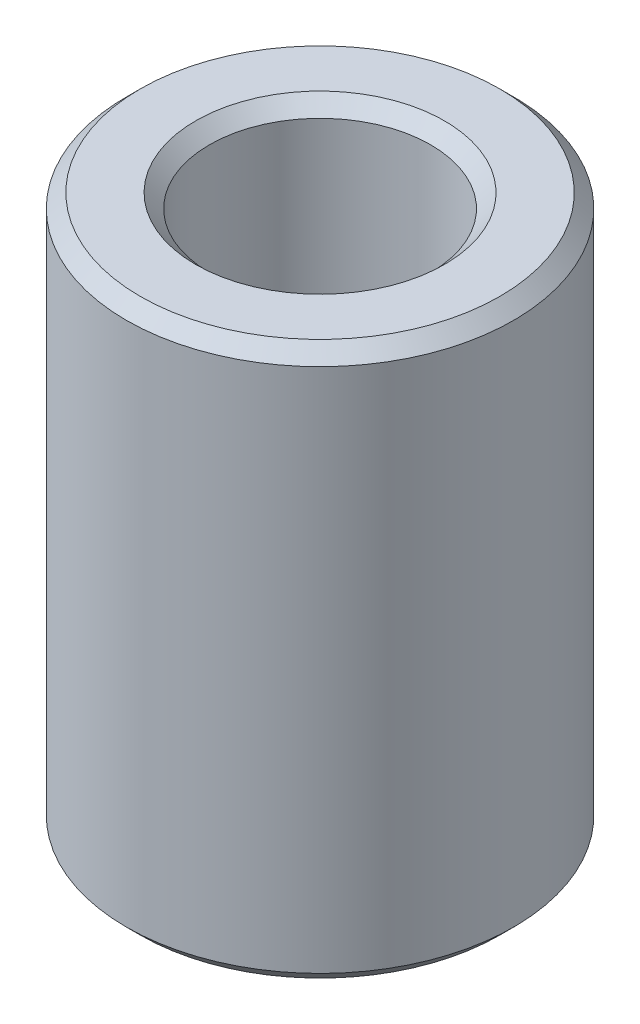
ISO-10303-21;
HEADER;
FILE_DESCRIPTION(('STEP AP214'),'2;1');
FILE_NAME('part.step','',(''),(''),'','','');
FILE_SCHEMA(('AUTOMOTIVE_DESIGN { 1 0 10303 214 1 1 1 1 }'));
ENDSEC;
DATA;
#1=APPLICATION_CONTEXT('core data for automotive mechanical design processes');
#2=APPLICATION_PROTOCOL_DEFINITION('international standard','automotive_design',2000,#1);
#3=PRODUCT_CONTEXT('',#1,'mechanical');
#4=PRODUCT('Part','Part','',(#3));
#5=PRODUCT_RELATED_PRODUCT_CATEGORY('part','',(#4));
#6=PRODUCT_DEFINITION_FORMATION('','',#4);
#7=PRODUCT_DEFINITION_CONTEXT('part definition',#1,'design');
#8=PRODUCT_DEFINITION('design','',#6,#7);
#9=PRODUCT_DEFINITION_SHAPE('','',#8);
#10=(LENGTH_UNIT() NAMED_UNIT(*) SI_UNIT(.MILLI.,.METRE.));
#11=(NAMED_UNIT(*) PLANE_ANGLE_UNIT() SI_UNIT($,.RADIAN.));
#12=(NAMED_UNIT(*) SI_UNIT($,.STERADIAN.) SOLID_ANGLE_UNIT());
#13=UNCERTAINTY_MEASURE_WITH_UNIT(LENGTH_MEASURE(1.E-05),#10,'distance_accuracy_value','');
#14=(GEOMETRIC_REPRESENTATION_CONTEXT(3) GLOBAL_UNCERTAINTY_ASSIGNED_CONTEXT((#13)) GLOBAL_UNIT_ASSIGNED_CONTEXT((#10,
#11,#12)) REPRESENTATION_CONTEXT('',''));
#15=CARTESIAN_POINT('',(0.,0.,0.));
#16=DIRECTION('',(0.,0.,1.));
#17=DIRECTION('',(1.,0.,0.));
#18=AXIS2_PLACEMENT_3D('',#15,#16,#17);
#19=CARTESIAN_POINT('',(0.,20.,0.));
#20=DIRECTION('',(0.,1.,0.));
#21=DIRECTION('',(0.,0.,1.));
#22=AXIS2_PLACEMENT_3D('',#19,#20,#21);
#23=PLANE('',#22);
#24=CARTESIAN_POINT('',(0.,20.,0.));
#25=DIRECTION('',(0.,1.,0.));
#26=DIRECTION('',(0.,0.,1.));
#27=AXIS2_PLACEMENT_3D('',#24,#25,#26);
#28=CIRCLE('',#27,4.50000000000001);
#29=CARTESIAN_POINT('',(0.,20.,4.50000000000001));
#30=VERTEX_POINT('',#29);
#31=EDGE_CURVE('E41',#30,#30,#28,.F.);
#32=ORIENTED_EDGE('',*,*,#31,.T.);
#33=EDGE_LOOP('',(#32));
#34=FACE_BOUND('',#33,.T.);
#35=CARTESIAN_POINT('',(0.,20.,0.));
#36=DIRECTION('',(0.,1.,0.));
#37=DIRECTION('',(0.,0.,1.));
#38=AXIS2_PLACEMENT_3D('',#35,#36,#37);
#39=CIRCLE('',#38,6.49999999999999);
#40=CARTESIAN_POINT('',(0.,20.,6.49999999999999));
#41=VERTEX_POINT('',#40);
#42=EDGE_CURVE('E45',#41,#41,#39,.T.);
#43=ORIENTED_EDGE('',*,*,#42,.T.);
#44=EDGE_LOOP('',(#43));
#45=FACE_BOUND('',#44,.T.);
#46=ADVANCED_FACE('F30',(#34,#45),#23,.T.);
#47=CARTESIAN_POINT('',(0.,0.,0.));
#48=DIRECTION('',(0.,1.,0.));
#49=DIRECTION('',(0.,0.,1.));
#50=AXIS2_PLACEMENT_3D('',#47,#48,#49);
#51=PLANE('',#50);
#52=CARTESIAN_POINT('',(0.,0.,0.));
#53=DIRECTION('',(0.,1.,0.));
#54=DIRECTION('',(0.,0.,1.));
#55=AXIS2_PLACEMENT_3D('',#52,#53,#54);
#56=CIRCLE('',#55,4.5);
#57=CARTESIAN_POINT('',(0.,0.,4.5));
#58=VERTEX_POINT('',#57);
#59=EDGE_CURVE('E56',#58,#58,#56,.T.);
#60=ORIENTED_EDGE('',*,*,#59,.T.);
#61=EDGE_LOOP('',(#60));
#62=FACE_BOUND('',#61,.T.);
#63=CARTESIAN_POINT('',(0.,0.,0.));
#64=DIRECTION('',(0.,1.,0.));
#65=DIRECTION('',(0.,0.,1.));
#66=AXIS2_PLACEMENT_3D('',#63,#64,#65);
#67=CIRCLE('',#66,6.49999999999999);
#68=CARTESIAN_POINT('',(0.,0.,6.49999999999999));
#69=VERTEX_POINT('',#68);
#70=EDGE_CURVE('E59',#69,#69,#67,.F.);
#71=ORIENTED_EDGE('',*,*,#70,.T.);
#72=EDGE_LOOP('',(#71));
#73=FACE_BOUND('',#72,.T.);
#74=ADVANCED_FACE('F63',(#62,#73),#51,.F.);
#75=CARTESIAN_POINT('',(0.,20.,0.));
#76=DIRECTION('',(0.,-1.,0.));
#77=DIRECTION('',(0.,0.,-1.));
#78=AXIS2_PLACEMENT_3D('',#75,#76,#77);
#79=CYLINDRICAL_SURFACE('',#78,7.);
#80=CARTESIAN_POINT('',(0.,0.500000000000007,0.));
#81=DIRECTION('',(0.,1.,0.));
#82=DIRECTION('',(0.,0.,1.));
#83=AXIS2_PLACEMENT_3D('',#80,#81,#82);
#84=CIRCLE('',#83,7.);
#85=CARTESIAN_POINT('',(0.,0.500000000000007,7.));
#86=VERTEX_POINT('',#85);
#87=EDGE_CURVE('E10',#86,#86,#84,.T.);
#88=ORIENTED_EDGE('',*,*,#87,.T.);
#89=EDGE_LOOP('',(#88));
#90=FACE_BOUND('',#89,.T.);
#91=CARTESIAN_POINT('',(0.,19.5,0.));
#92=DIRECTION('',(0.,1.,0.));
#93=DIRECTION('',(0.,0.,1.));
#94=AXIS2_PLACEMENT_3D('',#91,#92,#93);
#95=CIRCLE('',#94,7.);
#96=CARTESIAN_POINT('',(0.,19.5,7.));
#97=VERTEX_POINT('',#96);
#98=EDGE_CURVE('E37',#97,#97,#95,.F.);
#99=ORIENTED_EDGE('',*,*,#98,.T.);
#100=EDGE_LOOP('',(#99));
#101=FACE_BOUND('',#100,.T.);
#102=ADVANCED_FACE('F83',(#90,#101),#79,.T.);
#103=CARTESIAN_POINT('',(0.,20.,0.));
#104=DIRECTION('',(0.,-1.,0.));
#105=DIRECTION('',(0.,0.,-1.));
#106=AXIS2_PLACEMENT_3D('',#103,#104,#105);
#107=CYLINDRICAL_SURFACE('',#106,4.);
#108=CARTESIAN_POINT('',(0.,0.5,0.));
#109=DIRECTION('',(0.,1.,0.));
#110=DIRECTION('',(0.,0.,1.));
#111=AXIS2_PLACEMENT_3D('',#108,#109,#110);
#112=CIRCLE('',#111,4.);
#113=CARTESIAN_POINT('',(0.,0.5,4.));
#114=VERTEX_POINT('',#113);
#115=EDGE_CURVE('E50',#114,#114,#112,.F.);
#116=ORIENTED_EDGE('',*,*,#115,.T.);
#117=EDGE_LOOP('',(#116));
#118=FACE_BOUND('',#117,.T.);
#119=CARTESIAN_POINT('',(0.,19.5,0.));
#120=DIRECTION('',(0.,1.,0.));
#121=DIRECTION('',(0.,0.,1.));
#122=AXIS2_PLACEMENT_3D('',#119,#120,#121);
#123=CIRCLE('',#122,4.);
#124=CARTESIAN_POINT('',(0.,19.5,4.));
#125=VERTEX_POINT('',#124);
#126=EDGE_CURVE('E53',#125,#125,#123,.T.);
#127=ORIENTED_EDGE('',*,*,#126,.T.);
#128=EDGE_LOOP('',(#127));
#129=FACE_BOUND('',#128,.T.);
#130=ADVANCED_FACE('F88',(#118,#129),#107,.F.);
#131=CARTESIAN_POINT('',(0.,0.,0.));
#132=DIRECTION('',(0.,-1.,0.));
#133=DIRECTION('',(0.,0.,-1.));
#134=AXIS2_PLACEMENT_3D('',#131,#132,#133);
#135=CONICAL_SURFACE('',#134,4.5,0.785398163397448);
#136=ORIENTED_EDGE('',*,*,#115,.F.);
#137=EDGE_LOOP('',(#136));
#138=FACE_BOUND('',#137,.T.);
#139=ORIENTED_EDGE('',*,*,#59,.F.);
#140=EDGE_LOOP('',(#139));
#141=FACE_BOUND('',#140,.T.);
#142=ADVANCED_FACE('F74',(#138,#141),#135,.F.);
#143=CARTESIAN_POINT('',(0.,19.5,0.));
#144=DIRECTION('',(0.,1.,0.));
#145=DIRECTION('',(0.,0.,1.));
#146=AXIS2_PLACEMENT_3D('',#143,#144,#145);
#147=CONICAL_SURFACE('',#146,4.,0.785398163397455);
#148=ORIENTED_EDGE('',*,*,#31,.F.);
#149=EDGE_LOOP('',(#148));
#150=FACE_BOUND('',#149,.T.);
#151=ORIENTED_EDGE('',*,*,#126,.F.);
#152=EDGE_LOOP('',(#151));
#153=FACE_BOUND('',#152,.T.);
#154=ADVANCED_FACE('F68',(#150,#153),#147,.F.);
#155=CARTESIAN_POINT('',(0.,0.500000000000007,0.));
#156=DIRECTION('',(0.,1.,0.));
#157=DIRECTION('',(0.,0.,1.));
#158=AXIS2_PLACEMENT_3D('',#155,#156,#157);
#159=CONICAL_SURFACE('',#158,7.,0.785398163397453);
#160=ORIENTED_EDGE('',*,*,#70,.F.);
#161=EDGE_LOOP('',(#160));
#162=FACE_BOUND('',#161,.T.);
#163=ORIENTED_EDGE('',*,*,#87,.F.);
#164=EDGE_LOOP('',(#163));
#165=FACE_BOUND('',#164,.T.);
#166=ADVANCED_FACE('F65',(#162,#165),#159,.T.);
#167=CARTESIAN_POINT('',(0.,20.,0.));
#168=DIRECTION('',(0.,-1.,0.));
#169=DIRECTION('',(0.,0.,-1.));
#170=AXIS2_PLACEMENT_3D('',#167,#168,#169);
#171=CONICAL_SURFACE('',#170,6.49999999999999,0.785398163397448);
#172=ORIENTED_EDGE('',*,*,#98,.F.);
#173=EDGE_LOOP('',(#172));
#174=FACE_BOUND('',#173,.T.);
#175=ORIENTED_EDGE('',*,*,#42,.F.);
#176=EDGE_LOOP('',(#175));
#177=FACE_BOUND('',#176,.T.);
#178=ADVANCED_FACE('F32',(#174,#177),#171,.T.);
#179=CLOSED_SHELL('',(#46,#74,#102,#130,#142,#154,#166,#178));
#180=MANIFOLD_SOLID_BREP('B2',#179);
#181=ADVANCED_BREP_SHAPE_REPRESENTATION('',(#18,#180),#14);
#182=SHAPE_DEFINITION_REPRESENTATION(#9,#181);
ENDSEC;
END-ISO-10303-21;
